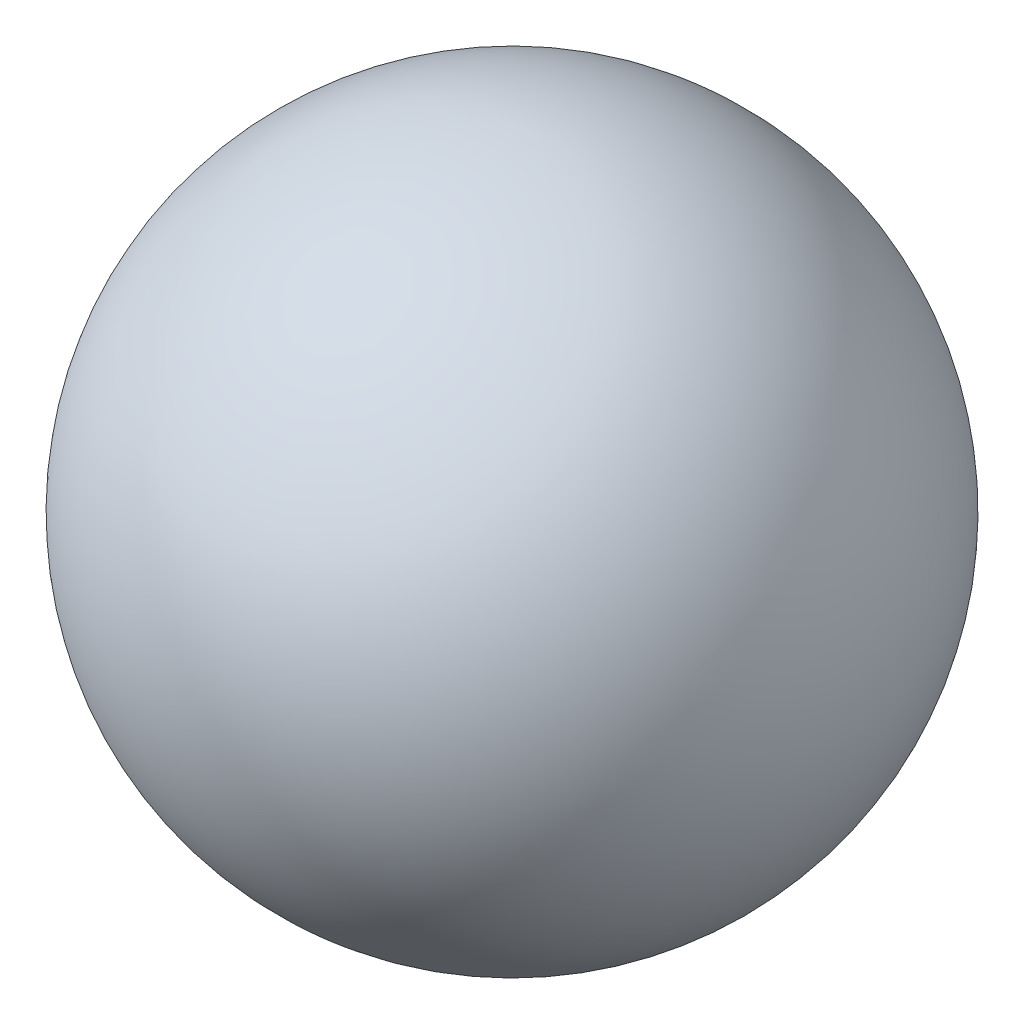
ISO-10303-21;
HEADER;
FILE_DESCRIPTION(('STEP AP214'),'2;1');
FILE_NAME('part.step','',(''),(''),'','','');
FILE_SCHEMA(('AUTOMOTIVE_DESIGN { 1 0 10303 214 1 1 1 1 }'));
ENDSEC;
DATA;
#1=APPLICATION_CONTEXT('core data for automotive mechanical design processes');
#2=APPLICATION_PROTOCOL_DEFINITION('international standard','automotive_design',2000,#1);
#3=PRODUCT_CONTEXT('',#1,'mechanical');
#4=PRODUCT('Part','Part','',(#3));
#5=PRODUCT_RELATED_PRODUCT_CATEGORY('part','',(#4));
#6=PRODUCT_DEFINITION_FORMATION('','',#4);
#7=PRODUCT_DEFINITION_CONTEXT('part definition',#1,'design');
#8=PRODUCT_DEFINITION('design','',#6,#7);
#9=PRODUCT_DEFINITION_SHAPE('','',#8);
#10=(LENGTH_UNIT() NAMED_UNIT(*) SI_UNIT(.MILLI.,.METRE.));
#11=(NAMED_UNIT(*) PLANE_ANGLE_UNIT() SI_UNIT($,.RADIAN.));
#12=(NAMED_UNIT(*) SI_UNIT($,.STERADIAN.) SOLID_ANGLE_UNIT());
#13=UNCERTAINTY_MEASURE_WITH_UNIT(LENGTH_MEASURE(1.E-05),#10,'distance_accuracy_value','');
#14=(GEOMETRIC_REPRESENTATION_CONTEXT(3) GLOBAL_UNCERTAINTY_ASSIGNED_CONTEXT((#13)) GLOBAL_UNIT_ASSIGNED_CONTEXT((#10,
#11,#12)) REPRESENTATION_CONTEXT('',''));
#15=CARTESIAN_POINT('',(0.,0.,0.));
#16=DIRECTION('',(0.,0.,1.));
#17=DIRECTION('',(1.,0.,0.));
#18=AXIS2_PLACEMENT_3D('',#15,#16,#17);
#19=CARTESIAN_POINT('',(64.16,-57.0308282276943,39.5156338765207));
#20=DIRECTION('',(0.,-0.821971206602406,0.569529047122795));
#21=DIRECTION('',(0.173648177666936,-0.56087662117218,-0.809483617014842));
#22=AXIS2_PLACEMENT_3D('',#19,#20,#21);
#23=SPHERICAL_SURFACE('',#22,7.15);
#24=CARTESIAN_POINT('',(64.16,-51.1537341004872,35.4435011895927));
#25=VERTEX_POINT('',#24);
#26=VERTEX_LOOP('',#25);
#27=FACE_BOUND('',#26,.T.);
#28=CARTESIAN_POINT('',(64.16,-62.9079223549015,43.5877665634488));
#29=VERTEX_POINT('',#28);
#30=VERTEX_LOOP('',#29);
#31=FACE_BOUND('',#30,.T.);
#32=ADVANCED_FACE('F20',(#27,#31),#23,.T.);
#33=CLOSED_SHELL('',(#32));
#34=MANIFOLD_SOLID_BREP('B1',#33);
#35=ADVANCED_BREP_SHAPE_REPRESENTATION('',(#18,#34),#14);
#36=SHAPE_DEFINITION_REPRESENTATION(#9,#35);
ENDSEC;
END-ISO-10303-21;
